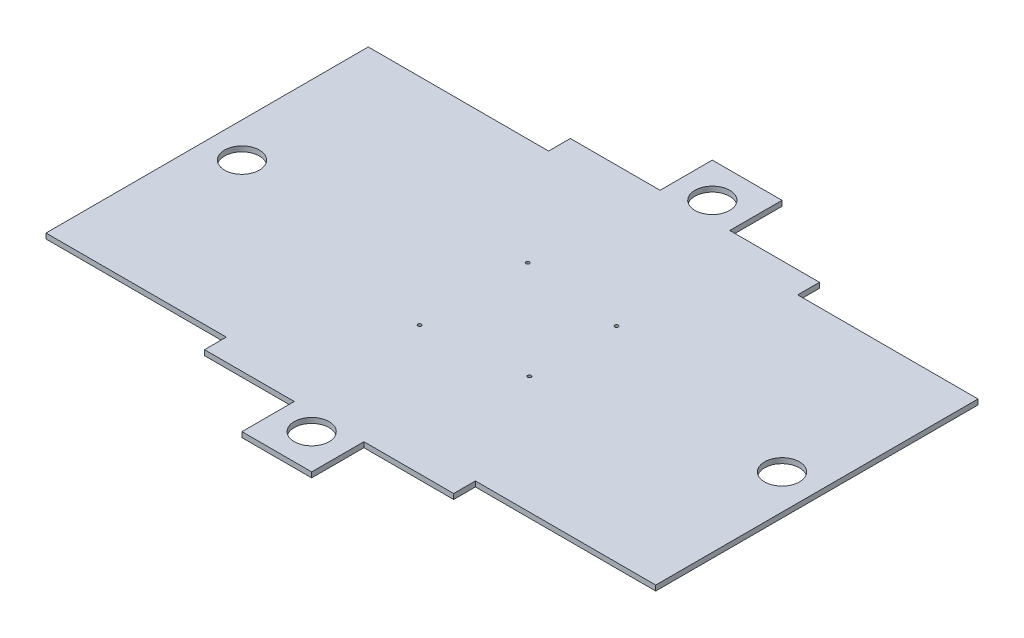
ISO-10303-21;
HEADER;
FILE_DESCRIPTION(('STEP AP214'),'2;1');
FILE_NAME('part.step','',(''),(''),'','','');
FILE_SCHEMA(('AUTOMOTIVE_DESIGN { 1 0 10303 214 1 1 1 1 }'));
ENDSEC;
DATA;
#1=APPLICATION_CONTEXT('core data for automotive mechanical design processes');
#2=APPLICATION_PROTOCOL_DEFINITION('international standard','automotive_design',2000,#1);
#3=PRODUCT_CONTEXT('',#1,'mechanical');
#4=PRODUCT('Part','Part','',(#3));
#5=PRODUCT_RELATED_PRODUCT_CATEGORY('part','',(#4));
#6=PRODUCT_DEFINITION_FORMATION('','',#4);
#7=PRODUCT_DEFINITION_CONTEXT('part definition',#1,'design');
#8=PRODUCT_DEFINITION('design','',#6,#7);
#9=PRODUCT_DEFINITION_SHAPE('','',#8);
#10=(LENGTH_UNIT() NAMED_UNIT(*) SI_UNIT(.MILLI.,.METRE.));
#11=(NAMED_UNIT(*) PLANE_ANGLE_UNIT() SI_UNIT($,.RADIAN.));
#12=(NAMED_UNIT(*) SI_UNIT($,.STERADIAN.) SOLID_ANGLE_UNIT());
#13=UNCERTAINTY_MEASURE_WITH_UNIT(LENGTH_MEASURE(1.E-05),#10,'distance_accuracy_value','');
#14=(GEOMETRIC_REPRESENTATION_CONTEXT(3) GLOBAL_UNCERTAINTY_ASSIGNED_CONTEXT((#13)) GLOBAL_UNIT_ASSIGNED_CONTEXT((#10,
#11,#12)) REPRESENTATION_CONTEXT('',''));
#15=CARTESIAN_POINT('',(0.,0.,0.));
#16=DIRECTION('',(0.,0.,1.));
#17=DIRECTION('',(1.,0.,0.));
#18=AXIS2_PLACEMENT_3D('',#15,#16,#17);
#19=CARTESIAN_POINT('',(0.,3.,-69.7038109466497));
#20=DIRECTION('',(0.,0.,-1.));
#21=DIRECTION('',(-1.,0.,0.));
#22=AXIS2_PLACEMENT_3D('',#19,#20,#21);
#23=PLANE('',#22);
#24=DIRECTION('',(1.,0.,0.));
#25=VECTOR('',#24,1.);
#26=CARTESIAN_POINT('',(0.,0.,-69.7038109466497));
#27=LINE('',#26,#25);
#28=CARTESIAN_POINT('',(-215.290938791968,0.,-69.7038109466496));
#29=VERTEX_POINT('',#28);
#30=CARTESIAN_POINT('',(-111.790938791968,0.,-69.7038109466496));
#31=VERTEX_POINT('',#30);
#32=EDGE_CURVE('E230',#29,#31,#27,.T.);
#33=ORIENTED_EDGE('',*,*,#32,.F.);
#34=DIRECTION('',(0.,-1.,0.));
#35=VECTOR('',#34,1.);
#36=CARTESIAN_POINT('',(-215.290938791968,3.,-69.7038109466496));
#37=LINE('',#36,#35);
#38=CARTESIAN_POINT('',(-215.290938791968,3.,-69.7038109466496));
#39=VERTEX_POINT('',#38);
#40=EDGE_CURVE('E11',#39,#29,#37,.T.);
#41=ORIENTED_EDGE('',*,*,#40,.F.);
#42=DIRECTION('',(1.,0.,0.));
#43=VECTOR('',#42,1.);
#44=CARTESIAN_POINT('',(0.,3.,-69.7038109466497));
#45=LINE('',#44,#43);
#46=CARTESIAN_POINT('',(-111.790938791968,3.,-69.7038109466496));
#47=VERTEX_POINT('',#46);
#48=EDGE_CURVE('E366',#39,#47,#45,.T.);
#49=ORIENTED_EDGE('',*,*,#48,.T.);
#50=DIRECTION('',(0.,-1.,0.));
#51=VECTOR('',#50,1.);
#52=CARTESIAN_POINT('',(-111.790938791968,3.,-69.7038109466496));
#53=LINE('',#52,#51);
#54=EDGE_CURVE('E56',#47,#31,#53,.T.);
#55=ORIENTED_EDGE('',*,*,#54,.T.);
#56=EDGE_LOOP('',(#33,#41,#49,#55));
#57=FACE_BOUND('',#56,.T.);
#58=ADVANCED_FACE('F39',(#57),#23,.T.);
#59=CARTESIAN_POINT('',(-215.290938791968,3.,0.));
#60=DIRECTION('',(-1.,0.,0.));
#61=DIRECTION('',(0.,0.,1.));
#62=AXIS2_PLACEMENT_3D('',#59,#60,#61);
#63=PLANE('',#62);
#64=DIRECTION('',(0.,0.,-1.));
#65=VECTOR('',#64,1.);
#66=CARTESIAN_POINT('',(-215.290938791968,0.,0.));
#67=LINE('',#66,#65);
#68=CARTESIAN_POINT('',(-215.290938791968,0.,115.29618905335));
#69=VERTEX_POINT('',#68);
#70=EDGE_CURVE('E232',#69,#29,#67,.T.);
#71=ORIENTED_EDGE('',*,*,#70,.F.);
#72=DIRECTION('',(0.,-1.,0.));
#73=VECTOR('',#72,1.);
#74=CARTESIAN_POINT('',(-215.290938791968,3.,115.29618905335));
#75=LINE('',#74,#73);
#76=CARTESIAN_POINT('',(-215.290938791968,3.,115.29618905335));
#77=VERTEX_POINT('',#76);
#78=EDGE_CURVE('E48',#77,#69,#75,.T.);
#79=ORIENTED_EDGE('',*,*,#78,.F.);
#80=DIRECTION('',(0.,0.,-1.));
#81=VECTOR('',#80,1.);
#82=CARTESIAN_POINT('',(-215.290938791968,3.,0.));
#83=LINE('',#82,#81);
#84=EDGE_CURVE('E364',#77,#39,#83,.T.);
#85=ORIENTED_EDGE('',*,*,#84,.T.);
#86=ORIENTED_EDGE('',*,*,#40,.T.);
#87=EDGE_LOOP('',(#71,#79,#85,#86));
#88=FACE_BOUND('',#87,.T.);
#89=ADVANCED_FACE('F350',(#88),#63,.T.);
#90=CARTESIAN_POINT('',(0.,3.,115.29618905335));
#91=DIRECTION('',(0.,0.,1.));
#92=DIRECTION('',(1.,0.,0.));
#93=AXIS2_PLACEMENT_3D('',#90,#91,#92);
#94=PLANE('',#93);
#95=DIRECTION('',(-1.,0.,0.));
#96=VECTOR('',#95,1.);
#97=CARTESIAN_POINT('',(0.,0.,115.29618905335));
#98=LINE('',#97,#96);
#99=CARTESIAN_POINT('',(-111.790938791968,0.,115.29618905335));
#100=VERTEX_POINT('',#99);
#101=EDGE_CURVE('E235',#100,#69,#98,.T.);
#102=ORIENTED_EDGE('',*,*,#101,.F.);
#103=DIRECTION('',(0.,-1.,0.));
#104=VECTOR('',#103,1.);
#105=CARTESIAN_POINT('',(-111.790938791968,3.,115.29618905335));
#106=LINE('',#105,#104);
#107=CARTESIAN_POINT('',(-111.790938791968,3.,115.29618905335));
#108=VERTEX_POINT('',#107);
#109=EDGE_CURVE('E339',#108,#100,#106,.T.);
#110=ORIENTED_EDGE('',*,*,#109,.F.);
#111=DIRECTION('',(-1.,0.,0.));
#112=VECTOR('',#111,1.);
#113=CARTESIAN_POINT('',(0.,3.,115.29618905335));
#114=LINE('',#113,#112);
#115=EDGE_CURVE('E346',#108,#77,#114,.T.);
#116=ORIENTED_EDGE('',*,*,#115,.T.);
#117=ORIENTED_EDGE('',*,*,#78,.T.);
#118=EDGE_LOOP('',(#102,#110,#116,#117));
#119=FACE_BOUND('',#118,.T.);
#120=ADVANCED_FACE('F344',(#119),#94,.T.);
#121=CARTESIAN_POINT('',(-111.790938791968,3.,2.48225748382609E-13));
#122=DIRECTION('',(1.,0.,0.));
#123=DIRECTION('',(0.,0.,-1.));
#124=AXIS2_PLACEMENT_3D('',#121,#122,#123);
#125=PLANE('',#124);
#126=DIRECTION('',(0.,0.,1.));
#127=VECTOR('',#126,1.);
#128=CARTESIAN_POINT('',(-111.790938791968,0.,2.48225748382609E-13));
#129=LINE('',#128,#127);
#130=CARTESIAN_POINT('',(-111.790938791968,0.,127.79618905335));
#131=VERTEX_POINT('',#130);
#132=EDGE_CURVE('E238',#100,#131,#129,.T.);
#133=ORIENTED_EDGE('',*,*,#132,.T.);
#134=DIRECTION('',(0.,-1.,0.));
#135=VECTOR('',#134,1.);
#136=CARTESIAN_POINT('',(-111.790938791968,3.,127.79618905335));
#137=LINE('',#136,#135);
#138=CARTESIAN_POINT('',(-111.790938791968,3.,127.79618905335));
#139=VERTEX_POINT('',#138);
#140=EDGE_CURVE('E336',#139,#131,#137,.T.);
#141=ORIENTED_EDGE('',*,*,#140,.F.);
#142=DIRECTION('',(0.,0.,1.));
#143=VECTOR('',#142,1.);
#144=CARTESIAN_POINT('',(-111.790938791968,3.,2.48225748382609E-13));
#145=LINE('',#144,#143);
#146=EDGE_CURVE('E360',#108,#139,#145,.T.);
#147=ORIENTED_EDGE('',*,*,#146,.F.);
#148=ORIENTED_EDGE('',*,*,#109,.T.);
#149=EDGE_LOOP('',(#133,#141,#147,#148));
#150=FACE_BOUND('',#149,.T.);
#151=ADVANCED_FACE('F357',(#150),#125,.F.);
#152=CARTESIAN_POINT('',(-1.37749778200359E-13,3.,127.79618905335));
#153=DIRECTION('',(0.,0.,-1.));
#154=DIRECTION('',(-1.,0.,0.));
#155=AXIS2_PLACEMENT_3D('',#152,#153,#154);
#156=PLANE('',#155);
#157=DIRECTION('',(1.,0.,0.));
#158=VECTOR('',#157,1.);
#159=CARTESIAN_POINT('',(-1.37749778200359E-13,0.,127.79618905335));
#160=LINE('',#159,#158);
#161=CARTESIAN_POINT('',(-60.2909387919644,0.,127.79618905335));
#162=VERTEX_POINT('',#161);
#163=EDGE_CURVE('E241',#131,#162,#160,.T.);
#164=ORIENTED_EDGE('',*,*,#163,.T.);
#165=DIRECTION('',(0.,-1.,0.));
#166=VECTOR('',#165,1.);
#167=CARTESIAN_POINT('',(-60.2909387919644,3.,127.79618905335));
#168=LINE('',#167,#166);
#169=CARTESIAN_POINT('',(-60.2909387919644,3.,127.79618905335));
#170=VERTEX_POINT('',#169);
#171=EDGE_CURVE('E333',#170,#162,#168,.T.);
#172=ORIENTED_EDGE('',*,*,#171,.F.);
#173=DIRECTION('',(1.,0.,0.));
#174=VECTOR('',#173,1.);
#175=CARTESIAN_POINT('',(-1.37749778200359E-13,3.,127.79618905335));
#176=LINE('',#175,#174);
#177=EDGE_CURVE('E362',#139,#170,#176,.T.);
#178=ORIENTED_EDGE('',*,*,#177,.F.);
#179=ORIENTED_EDGE('',*,*,#140,.T.);
#180=EDGE_LOOP('',(#164,#172,#178,#179));
#181=FACE_BOUND('',#180,.T.);
#182=ADVANCED_FACE('F430',(#181),#156,.F.);
#183=CARTESIAN_POINT('',(-60.2909387919644,3.,0.));
#184=DIRECTION('',(1.,0.,0.));
#185=DIRECTION('',(0.,0.,-1.));
#186=AXIS2_PLACEMENT_3D('',#183,#184,#185);
#187=PLANE('',#186);
#188=DIRECTION('',(0.,0.,1.));
#189=VECTOR('',#188,1.);
#190=CARTESIAN_POINT('',(-60.2909387919644,0.,0.));
#191=LINE('',#190,#189);
#192=CARTESIAN_POINT('',(-60.2909387919644,0.,157.79618905335));
#193=VERTEX_POINT('',#192);
#194=EDGE_CURVE('E244',#162,#193,#191,.T.);
#195=ORIENTED_EDGE('',*,*,#194,.T.);
#196=DIRECTION('',(0.,-1.,0.));
#197=VECTOR('',#196,1.);
#198=CARTESIAN_POINT('',(-60.2909387919644,3.,157.79618905335));
#199=LINE('',#198,#197);
#200=CARTESIAN_POINT('',(-60.2909387919644,3.,157.79618905335));
#201=VERTEX_POINT('',#200);
#202=EDGE_CURVE('E330',#201,#193,#199,.T.);
#203=ORIENTED_EDGE('',*,*,#202,.F.);
#204=DIRECTION('',(0.,0.,1.));
#205=VECTOR('',#204,1.);
#206=CARTESIAN_POINT('',(-60.2909387919644,3.,0.));
#207=LINE('',#206,#205);
#208=EDGE_CURVE('E371',#170,#201,#207,.T.);
#209=ORIENTED_EDGE('',*,*,#208,.F.);
#210=ORIENTED_EDGE('',*,*,#171,.T.);
#211=EDGE_LOOP('',(#195,#203,#209,#210));
#212=FACE_BOUND('',#211,.T.);
#213=ADVANCED_FACE('F433',(#212),#187,.F.);
#214=CARTESIAN_POINT('',(0.,3.,157.79618905335));
#215=DIRECTION('',(0.,0.,-1.));
#216=DIRECTION('',(-1.,0.,0.));
#217=AXIS2_PLACEMENT_3D('',#214,#215,#216);
#218=PLANE('',#217);
#219=DIRECTION('',(1.,0.,0.));
#220=VECTOR('',#219,1.);
#221=CARTESIAN_POINT('',(0.,0.,157.79618905335));
#222=LINE('',#221,#220);
#223=CARTESIAN_POINT('',(-20.2909387919713,0.,157.79618905335));
#224=VERTEX_POINT('',#223);
#225=EDGE_CURVE('E247',#193,#224,#222,.T.);
#226=ORIENTED_EDGE('',*,*,#225,.T.);
#227=DIRECTION('',(0.,-1.,0.));
#228=VECTOR('',#227,1.);
#229=CARTESIAN_POINT('',(-20.2909387919713,3.,157.79618905335));
#230=LINE('',#229,#228);
#231=CARTESIAN_POINT('',(-20.2909387919713,3.,157.79618905335));
#232=VERTEX_POINT('',#231);
#233=EDGE_CURVE('E327',#232,#224,#230,.T.);
#234=ORIENTED_EDGE('',*,*,#233,.F.);
#235=DIRECTION('',(1.,0.,0.));
#236=VECTOR('',#235,1.);
#237=CARTESIAN_POINT('',(0.,3.,157.79618905335));
#238=LINE('',#237,#236);
#239=EDGE_CURVE('E374',#201,#232,#238,.T.);
#240=ORIENTED_EDGE('',*,*,#239,.F.);
#241=ORIENTED_EDGE('',*,*,#202,.T.);
#242=EDGE_LOOP('',(#226,#234,#240,#241));
#243=FACE_BOUND('',#242,.T.);
#244=ADVANCED_FACE('F437',(#243),#218,.F.);
#245=CARTESIAN_POINT('',(-20.2909387919713,3.,0.));
#246=DIRECTION('',(-1.,0.,0.));
#247=DIRECTION('',(0.,0.,1.));
#248=AXIS2_PLACEMENT_3D('',#245,#246,#247);
#249=PLANE('',#248);
#250=DIRECTION('',(0.,0.,-1.));
#251=VECTOR('',#250,1.);
#252=CARTESIAN_POINT('',(-20.2909387919713,0.,0.));
#253=LINE('',#252,#251);
#254=CARTESIAN_POINT('',(-20.2909387919713,0.,127.79618905335));
#255=VERTEX_POINT('',#254);
#256=EDGE_CURVE('E250',#224,#255,#253,.T.);
#257=ORIENTED_EDGE('',*,*,#256,.T.);
#258=DIRECTION('',(0.,-1.,0.));
#259=VECTOR('',#258,1.);
#260=CARTESIAN_POINT('',(-20.2909387919713,3.,127.79618905335));
#261=LINE('',#260,#259);
#262=CARTESIAN_POINT('',(-20.2909387919713,3.,127.79618905335));
#263=VERTEX_POINT('',#262);
#264=EDGE_CURVE('E325',#263,#255,#261,.T.);
#265=ORIENTED_EDGE('',*,*,#264,.F.);
#266=DIRECTION('',(0.,0.,-1.));
#267=VECTOR('',#266,1.);
#268=CARTESIAN_POINT('',(-20.2909387919713,3.,0.));
#269=LINE('',#268,#267);
#270=EDGE_CURVE('E377',#232,#263,#269,.T.);
#271=ORIENTED_EDGE('',*,*,#270,.F.);
#272=ORIENTED_EDGE('',*,*,#233,.T.);
#273=EDGE_LOOP('',(#257,#265,#271,#272));
#274=FACE_BOUND('',#273,.T.);
#275=ADVANCED_FACE('F441',(#274),#249,.F.);
#276=CARTESIAN_POINT('',(1.37749778200359E-13,3.,127.79618905335));
#277=DIRECTION('',(0.,0.,1.));
#278=DIRECTION('',(1.,0.,0.));
#279=AXIS2_PLACEMENT_3D('',#276,#277,#278);
#280=PLANE('',#279);
#281=DIRECTION('',(-1.,0.,0.));
#282=VECTOR('',#281,1.);
#283=CARTESIAN_POINT('',(1.37749778200359E-13,0.,127.79618905335));
#284=LINE('',#283,#282);
#285=CARTESIAN_POINT('',(31.209061208032,0.,127.79618905335));
#286=VERTEX_POINT('',#285);
#287=EDGE_CURVE('E253',#286,#255,#284,.T.);
#288=ORIENTED_EDGE('',*,*,#287,.F.);
#289=DIRECTION('',(0.,-1.,0.));
#290=VECTOR('',#289,1.);
#291=CARTESIAN_POINT('',(31.209061208032,3.,127.79618905335));
#292=LINE('',#291,#290);
#293=CARTESIAN_POINT('',(31.209061208032,3.,127.79618905335));
#294=VERTEX_POINT('',#293);
#295=EDGE_CURVE('E323',#294,#286,#292,.T.);
#296=ORIENTED_EDGE('',*,*,#295,.F.);
#297=DIRECTION('',(-1.,0.,0.));
#298=VECTOR('',#297,1.);
#299=CARTESIAN_POINT('',(1.37749778200359E-13,3.,127.79618905335));
#300=LINE('',#299,#298);
#301=EDGE_CURVE('E379',#294,#263,#300,.T.);
#302=ORIENTED_EDGE('',*,*,#301,.T.);
#303=ORIENTED_EDGE('',*,*,#264,.T.);
#304=EDGE_LOOP('',(#288,#296,#302,#303));
#305=FACE_BOUND('',#304,.T.);
#306=ADVANCED_FACE('F445',(#305),#280,.T.);
#307=CARTESIAN_POINT('',(31.2090612080317,3.,0.));
#308=DIRECTION('',(1.,0.,0.));
#309=DIRECTION('',(0.,0.,-1.));
#310=AXIS2_PLACEMENT_3D('',#307,#308,#309);
#311=PLANE('',#310);
#312=DIRECTION('',(0.,0.,1.));
#313=VECTOR('',#312,1.);
#314=CARTESIAN_POINT('',(31.2090612080317,0.,0.));
#315=LINE('',#314,#313);
#316=CARTESIAN_POINT('',(31.209061208032,0.,115.296189053348));
#317=VERTEX_POINT('',#316);
#318=EDGE_CURVE('E256',#317,#286,#315,.T.);
#319=ORIENTED_EDGE('',*,*,#318,.F.);
#320=DIRECTION('',(0.,-1.,0.));
#321=VECTOR('',#320,1.);
#322=CARTESIAN_POINT('',(31.209061208032,3.,115.296189053348));
#323=LINE('',#322,#321);
#324=CARTESIAN_POINT('',(31.209061208032,3.,115.296189053348));
#325=VERTEX_POINT('',#324);
#326=EDGE_CURVE('E321',#325,#317,#323,.T.);
#327=ORIENTED_EDGE('',*,*,#326,.F.);
#328=DIRECTION('',(0.,0.,1.));
#329=VECTOR('',#328,1.);
#330=CARTESIAN_POINT('',(31.2090612080317,3.,0.));
#331=LINE('',#330,#329);
#332=EDGE_CURVE('E382',#325,#294,#331,.T.);
#333=ORIENTED_EDGE('',*,*,#332,.T.);
#334=ORIENTED_EDGE('',*,*,#295,.T.);
#335=EDGE_LOOP('',(#319,#327,#333,#334));
#336=FACE_BOUND('',#335,.T.);
#337=ADVANCED_FACE('F449',(#336),#311,.T.);
#338=CARTESIAN_POINT('',(0.,3.,115.296189053348));
#339=DIRECTION('',(0.,0.,1.));
#340=DIRECTION('',(1.,0.,0.));
#341=AXIS2_PLACEMENT_3D('',#338,#339,#340);
#342=PLANE('',#341);
#343=DIRECTION('',(-1.,0.,0.));
#344=VECTOR('',#343,1.);
#345=CARTESIAN_POINT('',(0.,0.,115.296189053348));
#346=LINE('',#345,#344);
#347=CARTESIAN_POINT('',(134.709061208032,0.,115.296189053348));
#348=VERTEX_POINT('',#347);
#349=EDGE_CURVE('E259',#348,#317,#346,.T.);
#350=ORIENTED_EDGE('',*,*,#349,.F.);
#351=DIRECTION('',(0.,-1.,0.));
#352=VECTOR('',#351,1.);
#353=CARTESIAN_POINT('',(134.709061208032,3.,115.296189053348));
#354=LINE('',#353,#352);
#355=CARTESIAN_POINT('',(134.709061208032,3.,115.296189053348));
#356=VERTEX_POINT('',#355);
#357=EDGE_CURVE('E319',#356,#348,#354,.T.);
#358=ORIENTED_EDGE('',*,*,#357,.F.);
#359=DIRECTION('',(-1.,0.,0.));
#360=VECTOR('',#359,1.);
#361=CARTESIAN_POINT('',(0.,3.,115.296189053348));
#362=LINE('',#361,#360);
#363=EDGE_CURVE('E385',#356,#325,#362,.T.);
#364=ORIENTED_EDGE('',*,*,#363,.T.);
#365=ORIENTED_EDGE('',*,*,#326,.T.);
#366=EDGE_LOOP('',(#350,#358,#364,#365));
#367=FACE_BOUND('',#366,.T.);
#368=ADVANCED_FACE('F453',(#367),#342,.T.);
#369=CARTESIAN_POINT('',(134.709061208032,3.,0.));
#370=DIRECTION('',(1.,0.,0.));
#371=DIRECTION('',(0.,0.,-1.));
#372=AXIS2_PLACEMENT_3D('',#369,#370,#371);
#373=PLANE('',#372);
#374=DIRECTION('',(0.,0.,1.));
#375=VECTOR('',#374,1.);
#376=CARTESIAN_POINT('',(134.709061208032,0.,0.));
#377=LINE('',#376,#375);
#378=CARTESIAN_POINT('',(134.709061208032,0.,-69.7038109466495));
#379=VERTEX_POINT('',#378);
#380=EDGE_CURVE('E262',#379,#348,#377,.T.);
#381=ORIENTED_EDGE('',*,*,#380,.F.);
#382=DIRECTION('',(0.,-1.,0.));
#383=VECTOR('',#382,1.);
#384=CARTESIAN_POINT('',(134.709061208032,3.,-69.7038109466495));
#385=LINE('',#384,#383);
#386=CARTESIAN_POINT('',(134.709061208032,3.,-69.7038109466495));
#387=VERTEX_POINT('',#386);
#388=EDGE_CURVE('E317',#387,#379,#385,.T.);
#389=ORIENTED_EDGE('',*,*,#388,.F.);
#390=DIRECTION('',(0.,0.,1.));
#391=VECTOR('',#390,1.);
#392=CARTESIAN_POINT('',(134.709061208032,3.,0.));
#393=LINE('',#392,#391);
#394=EDGE_CURVE('E388',#387,#356,#393,.T.);
#395=ORIENTED_EDGE('',*,*,#394,.T.);
#396=ORIENTED_EDGE('',*,*,#357,.T.);
#397=EDGE_LOOP('',(#381,#389,#395,#396));
#398=FACE_BOUND('',#397,.T.);
#399=ADVANCED_FACE('F457',(#398),#373,.T.);
#400=CARTESIAN_POINT('',(1.12154747560999E-13,3.,-69.7038109466497));
#401=DIRECTION('',(0.,0.,-1.));
#402=DIRECTION('',(-1.,0.,0.));
#403=AXIS2_PLACEMENT_3D('',#400,#401,#402);
#404=PLANE('',#403);
#405=DIRECTION('',(1.,0.,0.));
#406=VECTOR('',#405,1.);
#407=CARTESIAN_POINT('',(1.12154747560999E-13,0.,-69.7038109466497));
#408=LINE('',#407,#406);
#409=CARTESIAN_POINT('',(31.2090612080319,0.,-69.7038109466496));
#410=VERTEX_POINT('',#409);
#411=EDGE_CURVE('E265',#410,#379,#408,.T.);
#412=ORIENTED_EDGE('',*,*,#411,.F.);
#413=DIRECTION('',(0.,-1.,0.));
#414=VECTOR('',#413,1.);
#415=CARTESIAN_POINT('',(31.2090612080319,3.,-69.7038109466496));
#416=LINE('',#415,#414);
#417=CARTESIAN_POINT('',(31.2090612080319,3.,-69.7038109466496));
#418=VERTEX_POINT('',#417);
#419=EDGE_CURVE('E315',#418,#410,#416,.T.);
#420=ORIENTED_EDGE('',*,*,#419,.F.);
#421=DIRECTION('',(1.,0.,0.));
#422=VECTOR('',#421,1.);
#423=CARTESIAN_POINT('',(1.12154747560999E-13,3.,-69.7038109466497));
#424=LINE('',#423,#422);
#425=EDGE_CURVE('E391',#418,#387,#424,.T.);
#426=ORIENTED_EDGE('',*,*,#425,.T.);
#427=ORIENTED_EDGE('',*,*,#388,.T.);
#428=EDGE_LOOP('',(#412,#420,#426,#427));
#429=FACE_BOUND('',#428,.T.);
#430=ADVANCED_FACE('F461',(#429),#404,.T.);
#431=CARTESIAN_POINT('',(31.2090612080316,3.,1.3859607332037E-13));
#432=DIRECTION('',(-1.,0.,0.));
#433=DIRECTION('',(0.,0.,1.));
#434=AXIS2_PLACEMENT_3D('',#431,#432,#433);
#435=PLANE('',#434);
#436=DIRECTION('',(0.,0.,-1.));
#437=VECTOR('',#436,1.);
#438=CARTESIAN_POINT('',(31.2090612080316,0.,1.3859607332037E-13));
#439=LINE('',#438,#437);
#440=CARTESIAN_POINT('',(31.2090612080319,0.,-82.2038109466496));
#441=VERTEX_POINT('',#440);
#442=EDGE_CURVE('E268',#410,#441,#439,.T.);
#443=ORIENTED_EDGE('',*,*,#442,.T.);
#444=DIRECTION('',(0.,-1.,0.));
#445=VECTOR('',#444,1.);
#446=CARTESIAN_POINT('',(31.2090612080319,3.,-82.2038109466496));
#447=LINE('',#446,#445);
#448=CARTESIAN_POINT('',(31.2090612080319,3.,-82.2038109466496));
#449=VERTEX_POINT('',#448);
#450=EDGE_CURVE('E312',#449,#441,#447,.T.);
#451=ORIENTED_EDGE('',*,*,#450,.F.);
#452=DIRECTION('',(0.,0.,-1.));
#453=VECTOR('',#452,1.);
#454=CARTESIAN_POINT('',(31.2090612080316,3.,1.3859607332037E-13));
#455=LINE('',#454,#453);
#456=EDGE_CURVE('E394',#418,#449,#455,.T.);
#457=ORIENTED_EDGE('',*,*,#456,.F.);
#458=ORIENTED_EDGE('',*,*,#419,.T.);
#459=EDGE_LOOP('',(#443,#451,#457,#458));
#460=FACE_BOUND('',#459,.T.);
#461=ADVANCED_FACE('F465',(#460),#435,.F.);
#462=CARTESIAN_POINT('',(0.,3.,-82.2038109466496));
#463=DIRECTION('',(0.,0.,1.));
#464=DIRECTION('',(1.,0.,0.));
#465=AXIS2_PLACEMENT_3D('',#462,#463,#464);
#466=PLANE('',#465);
#467=DIRECTION('',(-1.,0.,0.));
#468=VECTOR('',#467,1.);
#469=CARTESIAN_POINT('',(0.,0.,-82.2038109466496));
#470=LINE('',#469,#468);
#471=CARTESIAN_POINT('',(-20.2909387919714,0.,-82.2038109466496));
#472=VERTEX_POINT('',#471);
#473=EDGE_CURVE('E271',#441,#472,#470,.T.);
#474=ORIENTED_EDGE('',*,*,#473,.T.);
#475=DIRECTION('',(0.,-1.,0.));
#476=VECTOR('',#475,1.);
#477=CARTESIAN_POINT('',(-20.2909387919714,3.,-82.2038109466496));
#478=LINE('',#477,#476);
#479=CARTESIAN_POINT('',(-20.2909387919714,3.,-82.2038109466496));
#480=VERTEX_POINT('',#479);
#481=EDGE_CURVE('E310',#480,#472,#478,.T.);
#482=ORIENTED_EDGE('',*,*,#481,.F.);
#483=DIRECTION('',(-1.,0.,0.));
#484=VECTOR('',#483,1.);
#485=CARTESIAN_POINT('',(0.,3.,-82.2038109466496));
#486=LINE('',#485,#484);
#487=EDGE_CURVE('E397',#449,#480,#486,.T.);
#488=ORIENTED_EDGE('',*,*,#487,.F.);
#489=ORIENTED_EDGE('',*,*,#450,.T.);
#490=EDGE_LOOP('',(#474,#482,#488,#489));
#491=FACE_BOUND('',#490,.T.);
#492=ADVANCED_FACE('F469',(#491),#466,.F.);
#493=CARTESIAN_POINT('',(-20.2909387919714,3.,0.));
#494=DIRECTION('',(1.,0.,0.));
#495=DIRECTION('',(0.,0.,-1.));
#496=AXIS2_PLACEMENT_3D('',#493,#494,#495);
#497=PLANE('',#496);
#498=DIRECTION('',(0.,0.,1.));
#499=VECTOR('',#498,1.);
#500=CARTESIAN_POINT('',(-20.2909387919714,0.,0.));
#501=LINE('',#500,#499);
#502=CARTESIAN_POINT('',(-20.2909387919714,0.,-112.203810946649));
#503=VERTEX_POINT('',#502);
#504=EDGE_CURVE('E274',#503,#472,#501,.T.);
#505=ORIENTED_EDGE('',*,*,#504,.F.);
#506=DIRECTION('',(0.,-1.,0.));
#507=VECTOR('',#506,1.);
#508=CARTESIAN_POINT('',(-20.2909387919714,3.,-112.203810946649));
#509=LINE('',#508,#507);
#510=CARTESIAN_POINT('',(-20.2909387919714,3.,-112.203810946649));
#511=VERTEX_POINT('',#510);
#512=EDGE_CURVE('E308',#511,#503,#509,.T.);
#513=ORIENTED_EDGE('',*,*,#512,.F.);
#514=DIRECTION('',(0.,0.,1.));
#515=VECTOR('',#514,1.);
#516=CARTESIAN_POINT('',(-20.2909387919714,3.,0.));
#517=LINE('',#516,#515);
#518=EDGE_CURVE('E399',#511,#480,#517,.T.);
#519=ORIENTED_EDGE('',*,*,#518,.T.);
#520=ORIENTED_EDGE('',*,*,#481,.T.);
#521=EDGE_LOOP('',(#505,#513,#519,#520));
#522=FACE_BOUND('',#521,.T.);
#523=ADVANCED_FACE('F473',(#522),#497,.T.);
#524=CARTESIAN_POINT('',(-5.83927754829751E-13,3.,-112.203810946649));
#525=DIRECTION('',(0.,0.,-1.));
#526=DIRECTION('',(-1.,0.,0.));
#527=AXIS2_PLACEMENT_3D('',#524,#525,#526);
#528=PLANE('',#527);
#529=DIRECTION('',(1.,0.,0.));
#530=VECTOR('',#529,1.);
#531=CARTESIAN_POINT('',(-5.83927754829751E-13,0.,-112.203810946649));
#532=LINE('',#531,#530);
#533=CARTESIAN_POINT('',(-60.2909387919644,0.,-112.203810946649));
#534=VERTEX_POINT('',#533);
#535=EDGE_CURVE('E277',#534,#503,#532,.T.);
#536=ORIENTED_EDGE('',*,*,#535,.F.);
#537=DIRECTION('',(0.,-1.,0.));
#538=VECTOR('',#537,1.);
#539=CARTESIAN_POINT('',(-60.2909387919644,3.,-112.203810946649));
#540=LINE('',#539,#538);
#541=CARTESIAN_POINT('',(-60.2909387919644,3.,-112.203810946649));
#542=VERTEX_POINT('',#541);
#543=EDGE_CURVE('E187',#542,#534,#540,.T.);
#544=ORIENTED_EDGE('',*,*,#543,.F.);
#545=DIRECTION('',(1.,0.,0.));
#546=VECTOR('',#545,1.);
#547=CARTESIAN_POINT('',(-5.83927754829751E-13,3.,-112.203810946649));
#548=LINE('',#547,#546);
#549=EDGE_CURVE('E198',#542,#511,#548,.T.);
#550=ORIENTED_EDGE('',*,*,#549,.T.);
#551=ORIENTED_EDGE('',*,*,#512,.T.);
#552=EDGE_LOOP('',(#536,#544,#550,#551));
#553=FACE_BOUND('',#552,.T.);
#554=ADVANCED_FACE('F403',(#553),#528,.T.);
#555=CARTESIAN_POINT('',(-60.2909387919644,3.,0.));
#556=DIRECTION('',(-1.,0.,0.));
#557=DIRECTION('',(0.,0.,1.));
#558=AXIS2_PLACEMENT_3D('',#555,#556,#557);
#559=PLANE('',#558);
#560=DIRECTION('',(0.,0.,-1.));
#561=VECTOR('',#560,1.);
#562=CARTESIAN_POINT('',(-60.2909387919644,0.,0.));
#563=LINE('',#562,#561);
#564=CARTESIAN_POINT('',(-60.2909387919644,0.,-82.2038109466495));
#565=VERTEX_POINT('',#564);
#566=EDGE_CURVE('E183',#565,#534,#563,.T.);
#567=ORIENTED_EDGE('',*,*,#566,.F.);
#568=DIRECTION('',(0.,-1.,0.));
#569=VECTOR('',#568,1.);
#570=CARTESIAN_POINT('',(-60.2909387919644,3.,-82.2038109466495));
#571=LINE('',#570,#569);
#572=CARTESIAN_POINT('',(-60.2909387919644,3.,-82.2038109466495));
#573=VERTEX_POINT('',#572);
#574=EDGE_CURVE('E178',#573,#565,#571,.T.);
#575=ORIENTED_EDGE('',*,*,#574,.F.);
#576=DIRECTION('',(0.,0.,-1.));
#577=VECTOR('',#576,1.);
#578=CARTESIAN_POINT('',(-60.2909387919644,3.,0.));
#579=LINE('',#578,#577);
#580=EDGE_CURVE('E181',#573,#542,#579,.T.);
#581=ORIENTED_EDGE('',*,*,#580,.T.);
#582=ORIENTED_EDGE('',*,*,#543,.T.);
#583=EDGE_LOOP('',(#567,#575,#581,#582));
#584=FACE_BOUND('',#583,.T.);
#585=ADVANCED_FACE('F180',(#584),#559,.T.);
#586=CARTESIAN_POINT('',(2.65819117354068E-13,3.,-82.2038109466493));
#587=DIRECTION('',(0.,0.,-1.));
#588=DIRECTION('',(-1.,0.,0.));
#589=AXIS2_PLACEMENT_3D('',#586,#587,#588);
#590=PLANE('',#589);
#591=DIRECTION('',(1.,0.,0.));
#592=VECTOR('',#591,1.);
#593=CARTESIAN_POINT('',(2.65819117354068E-13,0.,-82.2038109466493));
#594=LINE('',#593,#592);
#595=CARTESIAN_POINT('',(-111.790938791968,0.,-82.2038109466496));
#596=VERTEX_POINT('',#595);
#597=EDGE_CURVE('E281',#596,#565,#594,.T.);
#598=ORIENTED_EDGE('',*,*,#597,.F.);
#599=DIRECTION('',(0.,-1.,0.));
#600=VECTOR('',#599,1.);
#601=CARTESIAN_POINT('',(-111.790938791968,3.,-82.2038109466496));
#602=LINE('',#601,#600);
#603=CARTESIAN_POINT('',(-111.790938791968,3.,-82.2038109466496));
#604=VERTEX_POINT('',#603);
#605=EDGE_CURVE('E117',#604,#596,#602,.T.);
#606=ORIENTED_EDGE('',*,*,#605,.F.);
#607=DIRECTION('',(1.,0.,0.));
#608=VECTOR('',#607,1.);
#609=CARTESIAN_POINT('',(2.65819117354068E-13,3.,-82.2038109466493));
#610=LINE('',#609,#608);
#611=EDGE_CURVE('E195',#604,#573,#610,.T.);
#612=ORIENTED_EDGE('',*,*,#611,.T.);
#613=ORIENTED_EDGE('',*,*,#574,.T.);
#614=EDGE_LOOP('',(#598,#606,#612,#613));
#615=FACE_BOUND('',#614,.T.);
#616=ADVANCED_FACE('F200',(#615),#590,.T.);
#617=CARTESIAN_POINT('',(-5.29093879215605,3.,-2.20381094715202));
#618=DIRECTION('',(0.,-1.,0.));
#619=DIRECTION('',(0.,0.,-1.));
#620=AXIS2_PLACEMENT_3D('',#617,#618,#619);
#621=CYLINDRICAL_SURFACE('',#620,1.);
#622=CARTESIAN_POINT('',(-5.29093879215605,3.,-2.20381094715202));
#623=DIRECTION('',(0.,1.,0.));
#624=DIRECTION('',(0.,0.,1.));
#625=AXIS2_PLACEMENT_3D('',#622,#623,#624);
#626=CIRCLE('',#625,1.);
#627=CARTESIAN_POINT('',(-5.29093879215605,3.,-1.20381094715202));
#628=VERTEX_POINT('',#627);
#629=EDGE_CURVE('E218',#628,#628,#626,.T.);
#630=ORIENTED_EDGE('',*,*,#629,.T.);
#631=EDGE_LOOP('',(#630));
#632=FACE_BOUND('',#631,.T.);
#633=CARTESIAN_POINT('',(-5.29093879215605,0.,-2.20381094715202));
#634=DIRECTION('',(0.,1.,0.));
#635=DIRECTION('',(0.,0.,1.));
#636=AXIS2_PLACEMENT_3D('',#633,#634,#635);
#637=CIRCLE('',#636,1.);
#638=CARTESIAN_POINT('',(-5.29093879215605,0.,-1.20381094715202));
#639=VERTEX_POINT('',#638);
#640=EDGE_CURVE('E298',#639,#639,#637,.T.);
#641=ORIENTED_EDGE('',*,*,#640,.F.);
#642=EDGE_LOOP('',(#641));
#643=FACE_BOUND('',#642,.T.);
#644=ADVANCED_FACE('F482',(#632,#643),#621,.F.);
#645=CARTESIAN_POINT('',(-5.29093879215606,3.,47.796189052848));
#646=DIRECTION('',(0.,-1.,0.));
#647=DIRECTION('',(0.,0.,-1.));
#648=AXIS2_PLACEMENT_3D('',#645,#646,#647);
#649=CYLINDRICAL_SURFACE('',#648,1.);
#650=CARTESIAN_POINT('',(-5.29093879215606,3.,47.796189052848));
#651=DIRECTION('',(0.,1.,0.));
#652=DIRECTION('',(0.,0.,1.));
#653=AXIS2_PLACEMENT_3D('',#650,#651,#652);
#654=CIRCLE('',#653,1.);
#655=CARTESIAN_POINT('',(-5.29093879215606,3.,48.796189052848));
#656=VERTEX_POINT('',#655);
#657=EDGE_CURVE('E215',#656,#656,#654,.T.);
#658=ORIENTED_EDGE('',*,*,#657,.T.);
#659=EDGE_LOOP('',(#658));
#660=FACE_BOUND('',#659,.T.);
#661=CARTESIAN_POINT('',(-5.29093879215606,0.,47.796189052848));
#662=DIRECTION('',(0.,1.,0.));
#663=DIRECTION('',(0.,0.,1.));
#664=AXIS2_PLACEMENT_3D('',#661,#662,#663);
#665=CIRCLE('',#664,1.);
#666=CARTESIAN_POINT('',(-5.29093879215606,0.,48.796189052848));
#667=VERTEX_POINT('',#666);
#668=EDGE_CURVE('E295',#667,#667,#665,.T.);
#669=ORIENTED_EDGE('',*,*,#668,.F.);
#670=EDGE_LOOP('',(#669));
#671=FACE_BOUND('',#670,.T.);
#672=ADVANCED_FACE('F486',(#660,#671),#649,.F.);
#673=CARTESIAN_POINT('',(-62.2909387921561,3.,53.796189052848));
#674=DIRECTION('',(0.,-1.,0.));
#675=DIRECTION('',(0.,0.,-1.));
#676=AXIS2_PLACEMENT_3D('',#673,#674,#675);
#677=CYLINDRICAL_SURFACE('',#676,0.999999999999998);
#678=CARTESIAN_POINT('',(-62.2909387921561,3.,53.796189052848));
#679=DIRECTION('',(0.,1.,0.));
#680=DIRECTION('',(0.,0.,1.));
#681=AXIS2_PLACEMENT_3D('',#678,#679,#680);
#682=CIRCLE('',#681,0.999999999999998);
#683=CARTESIAN_POINT('',(-62.2909387921561,3.,54.796189052848));
#684=VERTEX_POINT('',#683);
#685=EDGE_CURVE('E212',#684,#684,#682,.T.);
#686=ORIENTED_EDGE('',*,*,#685,.T.);
#687=EDGE_LOOP('',(#686));
#688=FACE_BOUND('',#687,.T.);
#689=CARTESIAN_POINT('',(-62.2909387921561,0.,53.796189052848));
#690=DIRECTION('',(0.,1.,0.));
#691=DIRECTION('',(0.,0.,1.));
#692=AXIS2_PLACEMENT_3D('',#689,#690,#691);
#693=CIRCLE('',#692,0.999999999999998);
#694=CARTESIAN_POINT('',(-62.2909387921561,0.,54.796189052848));
#695=VERTEX_POINT('',#694);
#696=EDGE_CURVE('E292',#695,#695,#693,.T.);
#697=ORIENTED_EDGE('',*,*,#696,.F.);
#698=EDGE_LOOP('',(#697));
#699=FACE_BOUND('',#698,.T.);
#700=ADVANCED_FACE('F492',(#688,#699),#677,.F.);
#701=CARTESIAN_POINT('',(-195.290938791966,3.,22.7961890533391));
#702=DIRECTION('',(0.,-1.,0.));
#703=DIRECTION('',(0.,0.,-1.));
#704=AXIS2_PLACEMENT_3D('',#701,#702,#703);
#705=CYLINDRICAL_SURFACE('',#704,9.99999999999994);
#706=CARTESIAN_POINT('',(-195.290938791966,3.,22.7961890533391));
#707=DIRECTION('',(0.,1.,0.));
#708=DIRECTION('',(0.,0.,1.));
#709=AXIS2_PLACEMENT_3D('',#706,#707,#708);
#710=CIRCLE('',#709,9.99999999999994);
#711=CARTESIAN_POINT('',(-195.290938791966,3.,32.796189053339));
#712=VERTEX_POINT('',#711);
#713=EDGE_CURVE('E209',#712,#712,#710,.F.);
#714=ORIENTED_EDGE('',*,*,#713,.F.);
#715=EDGE_LOOP('',(#714));
#716=FACE_BOUND('',#715,.T.);
#717=CARTESIAN_POINT('',(-195.290938791966,0.,22.7961890533391));
#718=DIRECTION('',(0.,1.,0.));
#719=DIRECTION('',(0.,0.,1.));
#720=AXIS2_PLACEMENT_3D('',#717,#718,#719);
#721=CIRCLE('',#720,9.99999999999994);
#722=CARTESIAN_POINT('',(-195.290938791966,0.,32.796189053339));
#723=VERTEX_POINT('',#722);
#724=EDGE_CURVE('E289',#723,#723,#721,.F.);
#725=ORIENTED_EDGE('',*,*,#724,.T.);
#726=EDGE_LOOP('',(#725));
#727=FACE_BOUND('',#726,.T.);
#728=ADVANCED_FACE('F415',(#716,#727),#705,.F.);
#729=CARTESIAN_POINT('',(114.709061208037,3.,22.7961890533391));
#730=DIRECTION('',(0.,-1.,0.));
#731=DIRECTION('',(0.,0.,-1.));
#732=AXIS2_PLACEMENT_3D('',#729,#730,#731);
#733=CYLINDRICAL_SURFACE('',#732,9.99999999999183);
#734=CARTESIAN_POINT('',(114.709061208037,3.,22.7961890533391));
#735=DIRECTION('',(0.,1.,0.));
#736=DIRECTION('',(0.,0.,1.));
#737=AXIS2_PLACEMENT_3D('',#734,#735,#736);
#738=CIRCLE('',#737,9.99999999999183);
#739=CARTESIAN_POINT('',(114.709061208037,3.,32.7961890533309));
#740=VERTEX_POINT('',#739);
#741=EDGE_CURVE('E203',#740,#740,#738,.T.);
#742=ORIENTED_EDGE('',*,*,#741,.T.);
#743=EDGE_LOOP('',(#742));
#744=FACE_BOUND('',#743,.T.);
#745=CARTESIAN_POINT('',(114.709061208037,0.,22.7961890533391));
#746=DIRECTION('',(0.,1.,0.));
#747=DIRECTION('',(0.,0.,1.));
#748=AXIS2_PLACEMENT_3D('',#745,#746,#747);
#749=CIRCLE('',#748,9.99999999999183);
#750=CARTESIAN_POINT('',(114.709061208037,0.,32.7961890533309));
#751=VERTEX_POINT('',#750);
#752=EDGE_CURVE('E286',#751,#751,#749,.T.);
#753=ORIENTED_EDGE('',*,*,#752,.F.);
#754=EDGE_LOOP('',(#753));
#755=FACE_BOUND('',#754,.T.);
#756=ADVANCED_FACE('F408',(#744,#755),#733,.F.);
#757=CARTESIAN_POINT('',(-111.790938791968,3.,4.96451496765218E-13));
#758=DIRECTION('',(-1.,0.,0.));
#759=DIRECTION('',(0.,0.,1.));
#760=AXIS2_PLACEMENT_3D('',#757,#758,#759);
#761=PLANE('',#760);
#762=DIRECTION('',(0.,0.,-1.));
#763=VECTOR('',#762,1.);
#764=CARTESIAN_POINT('',(-111.790938791968,0.,4.96451496765218E-13));
#765=LINE('',#764,#763);
#766=EDGE_CURVE('E283',#31,#596,#765,.T.);
#767=ORIENTED_EDGE('',*,*,#766,.F.);
#768=ORIENTED_EDGE('',*,*,#54,.F.);
#769=DIRECTION('',(0.,0.,-1.));
#770=VECTOR('',#769,1.);
#771=CARTESIAN_POINT('',(-111.790938791968,3.,4.96451496765218E-13));
#772=LINE('',#771,#770);
#773=EDGE_CURVE('E201',#47,#604,#772,.T.);
#774=ORIENTED_EDGE('',*,*,#773,.T.);
#775=ORIENTED_EDGE('',*,*,#605,.T.);
#776=EDGE_LOOP('',(#767,#768,#774,#775));
#777=FACE_BOUND('',#776,.T.);
#778=ADVANCED_FACE('F405',(#777),#761,.T.);
#779=CARTESIAN_POINT('',(-40.2909387919671,3.,-92.203810946646));
#780=DIRECTION('',(0.,-1.,0.));
#781=DIRECTION('',(0.,0.,-1.));
#782=AXIS2_PLACEMENT_3D('',#779,#780,#781);
#783=CYLINDRICAL_SURFACE('',#782,10.0000000000001);
#784=CARTESIAN_POINT('',(-40.2909387919671,3.,-92.203810946646));
#785=DIRECTION('',(0.,1.,0.));
#786=DIRECTION('',(0.,0.,1.));
#787=AXIS2_PLACEMENT_3D('',#784,#785,#786);
#788=CIRCLE('',#787,10.0000000000001);
#789=CARTESIAN_POINT('',(-40.2909387919671,3.,-82.203810946646));
#790=VERTEX_POINT('',#789);
#791=EDGE_CURVE('E542',#790,#790,#788,.T.);
#792=ORIENTED_EDGE('',*,*,#791,.T.);
#793=EDGE_LOOP('',(#792));
#794=FACE_BOUND('',#793,.T.);
#795=CARTESIAN_POINT('',(-40.2909387919671,0.,-92.203810946646));
#796=DIRECTION('',(0.,1.,0.));
#797=DIRECTION('',(0.,0.,1.));
#798=AXIS2_PLACEMENT_3D('',#795,#796,#797);
#799=CIRCLE('',#798,10.0000000000001);
#800=CARTESIAN_POINT('',(-40.2909387919671,0.,-82.203810946646));
#801=VERTEX_POINT('',#800);
#802=EDGE_CURVE('E227',#801,#801,#799,.T.);
#803=ORIENTED_EDGE('',*,*,#802,.F.);
#804=EDGE_LOOP('',(#803));
#805=FACE_BOUND('',#804,.T.);
#806=ADVANCED_FACE('F407',(#794,#805),#783,.F.);
#807=CARTESIAN_POINT('',(-40.2909387919671,3.,137.796189053349));
#808=DIRECTION('',(0.,-1.,0.));
#809=DIRECTION('',(0.,0.,-1.));
#810=AXIS2_PLACEMENT_3D('',#807,#808,#809);
#811=CYLINDRICAL_SURFACE('',#810,9.99999999999997);
#812=CARTESIAN_POINT('',(-40.2909387919671,3.,137.796189053349));
#813=DIRECTION('',(0.,1.,0.));
#814=DIRECTION('',(0.,0.,1.));
#815=AXIS2_PLACEMENT_3D('',#812,#813,#814);
#816=CIRCLE('',#815,9.99999999999997);
#817=CARTESIAN_POINT('',(-40.2909387919671,3.,147.796189053349));
#818=VERTEX_POINT('',#817);
#819=EDGE_CURVE('E304',#818,#818,#816,.F.);
#820=ORIENTED_EDGE('',*,*,#819,.F.);
#821=EDGE_LOOP('',(#820));
#822=FACE_BOUND('',#821,.T.);
#823=CARTESIAN_POINT('',(-40.2909387919671,0.,137.796189053349));
#824=DIRECTION('',(0.,1.,0.));
#825=DIRECTION('',(0.,0.,1.));
#826=AXIS2_PLACEMENT_3D('',#823,#824,#825);
#827=CIRCLE('',#826,9.99999999999997);
#828=CARTESIAN_POINT('',(-40.2909387919671,0.,147.796189053349));
#829=VERTEX_POINT('',#828);
#830=EDGE_CURVE('E224',#829,#829,#827,.F.);
#831=ORIENTED_EDGE('',*,*,#830,.T.);
#832=EDGE_LOOP('',(#831));
#833=FACE_BOUND('',#832,.T.);
#834=ADVANCED_FACE('F41',(#822,#833),#811,.F.);
#835=CARTESIAN_POINT('',(-62.290938792156,3.,-8.20381094715209));
#836=DIRECTION('',(0.,-1.,0.));
#837=DIRECTION('',(0.,0.,-1.));
#838=AXIS2_PLACEMENT_3D('',#835,#836,#837);
#839=CYLINDRICAL_SURFACE('',#838,0.999999999999998);
#840=CARTESIAN_POINT('',(-62.290938792156,3.,-8.20381094715209));
#841=DIRECTION('',(0.,1.,0.));
#842=DIRECTION('',(0.,0.,1.));
#843=AXIS2_PLACEMENT_3D('',#840,#841,#842);
#844=CIRCLE('',#843,0.999999999999998);
#845=CARTESIAN_POINT('',(-62.290938792156,3.,-7.2038109471521));
#846=VERTEX_POINT('',#845);
#847=EDGE_CURVE('E221',#846,#846,#844,.T.);
#848=ORIENTED_EDGE('',*,*,#847,.T.);
#849=EDGE_LOOP('',(#848));
#850=FACE_BOUND('',#849,.T.);
#851=CARTESIAN_POINT('',(-62.290938792156,0.,-8.20381094715209));
#852=DIRECTION('',(0.,1.,0.));
#853=DIRECTION('',(0.,0.,1.));
#854=AXIS2_PLACEMENT_3D('',#851,#852,#853);
#855=CIRCLE('',#854,0.999999999999998);
#856=CARTESIAN_POINT('',(-62.290938792156,0.,-7.2038109471521));
#857=VERTEX_POINT('',#856);
#858=EDGE_CURVE('E301',#857,#857,#855,.T.);
#859=ORIENTED_EDGE('',*,*,#858,.F.);
#860=EDGE_LOOP('',(#859));
#861=FACE_BOUND('',#860,.T.);
#862=ADVANCED_FACE('F497',(#850,#861),#839,.F.);
#863=CARTESIAN_POINT('',(0.,3.,0.));
#864=DIRECTION('',(0.,1.,0.));
#865=DIRECTION('',(0.,0.,1.));
#866=AXIS2_PLACEMENT_3D('',#863,#864,#865);
#867=PLANE('',#866);
#868=ORIENTED_EDGE('',*,*,#819,.T.);
#869=EDGE_LOOP('',(#868));
#870=FACE_BOUND('',#869,.T.);
#871=ORIENTED_EDGE('',*,*,#791,.F.);
#872=EDGE_LOOP('',(#871));
#873=FACE_BOUND('',#872,.T.);
#874=ORIENTED_EDGE('',*,*,#48,.F.);
#875=ORIENTED_EDGE('',*,*,#84,.F.);
#876=ORIENTED_EDGE('',*,*,#115,.F.);
#877=ORIENTED_EDGE('',*,*,#146,.T.);
#878=ORIENTED_EDGE('',*,*,#177,.T.);
#879=ORIENTED_EDGE('',*,*,#208,.T.);
#880=ORIENTED_EDGE('',*,*,#239,.T.);
#881=ORIENTED_EDGE('',*,*,#270,.T.);
#882=ORIENTED_EDGE('',*,*,#301,.F.);
#883=ORIENTED_EDGE('',*,*,#332,.F.);
#884=ORIENTED_EDGE('',*,*,#363,.F.);
#885=ORIENTED_EDGE('',*,*,#394,.F.);
#886=ORIENTED_EDGE('',*,*,#425,.F.);
#887=ORIENTED_EDGE('',*,*,#456,.T.);
#888=ORIENTED_EDGE('',*,*,#487,.T.);
#889=ORIENTED_EDGE('',*,*,#518,.F.);
#890=ORIENTED_EDGE('',*,*,#549,.F.);
#891=ORIENTED_EDGE('',*,*,#580,.F.);
#892=ORIENTED_EDGE('',*,*,#611,.F.);
#893=ORIENTED_EDGE('',*,*,#773,.F.);
#894=EDGE_LOOP('',(#874,#875,#876,#877,#878,#879,#880,#881,#882,#883,#884,#885,#886,#887,#888,
#889,#890,#891,#892,#893));
#895=FACE_BOUND('',#894,.T.);
#896=ORIENTED_EDGE('',*,*,#741,.F.);
#897=EDGE_LOOP('',(#896));
#898=FACE_BOUND('',#897,.T.);
#899=ORIENTED_EDGE('',*,*,#713,.T.);
#900=EDGE_LOOP('',(#899));
#901=FACE_BOUND('',#900,.T.);
#902=ORIENTED_EDGE('',*,*,#685,.F.);
#903=EDGE_LOOP('',(#902));
#904=FACE_BOUND('',#903,.T.);
#905=ORIENTED_EDGE('',*,*,#657,.F.);
#906=EDGE_LOOP('',(#905));
#907=FACE_BOUND('',#906,.T.);
#908=ORIENTED_EDGE('',*,*,#629,.F.);
#909=EDGE_LOOP('',(#908));
#910=FACE_BOUND('',#909,.T.);
#911=ORIENTED_EDGE('',*,*,#847,.F.);
#912=EDGE_LOOP('',(#911));
#913=FACE_BOUND('',#912,.T.);
#914=ADVANCED_FACE('F192',(#870,#873,#895,#898,#901,#904,#907,#910,#913),#867,.T.);
#915=CARTESIAN_POINT('',(0.,0.,0.));
#916=DIRECTION('',(0.,1.,0.));
#917=DIRECTION('',(0.,0.,1.));
#918=AXIS2_PLACEMENT_3D('',#915,#916,#917);
#919=PLANE('',#918);
#920=ORIENTED_EDGE('',*,*,#830,.F.);
#921=EDGE_LOOP('',(#920));
#922=FACE_BOUND('',#921,.T.);
#923=ORIENTED_EDGE('',*,*,#802,.T.);
#924=EDGE_LOOP('',(#923));
#925=FACE_BOUND('',#924,.T.);
#926=ORIENTED_EDGE('',*,*,#32,.T.);
#927=ORIENTED_EDGE('',*,*,#766,.T.);
#928=ORIENTED_EDGE('',*,*,#597,.T.);
#929=ORIENTED_EDGE('',*,*,#566,.T.);
#930=ORIENTED_EDGE('',*,*,#535,.T.);
#931=ORIENTED_EDGE('',*,*,#504,.T.);
#932=ORIENTED_EDGE('',*,*,#473,.F.);
#933=ORIENTED_EDGE('',*,*,#442,.F.);
#934=ORIENTED_EDGE('',*,*,#411,.T.);
#935=ORIENTED_EDGE('',*,*,#380,.T.);
#936=ORIENTED_EDGE('',*,*,#349,.T.);
#937=ORIENTED_EDGE('',*,*,#318,.T.);
#938=ORIENTED_EDGE('',*,*,#287,.T.);
#939=ORIENTED_EDGE('',*,*,#256,.F.);
#940=ORIENTED_EDGE('',*,*,#225,.F.);
#941=ORIENTED_EDGE('',*,*,#194,.F.);
#942=ORIENTED_EDGE('',*,*,#163,.F.);
#943=ORIENTED_EDGE('',*,*,#132,.F.);
#944=ORIENTED_EDGE('',*,*,#101,.T.);
#945=ORIENTED_EDGE('',*,*,#70,.T.);
#946=EDGE_LOOP('',(#926,#927,#928,#929,#930,#931,#932,#933,#934,#935,#936,#937,#938,#939,#940,
#941,#942,#943,#944,#945));
#947=FACE_BOUND('',#946,.T.);
#948=ORIENTED_EDGE('',*,*,#752,.T.);
#949=EDGE_LOOP('',(#948));
#950=FACE_BOUND('',#949,.T.);
#951=ORIENTED_EDGE('',*,*,#724,.F.);
#952=EDGE_LOOP('',(#951));
#953=FACE_BOUND('',#952,.T.);
#954=ORIENTED_EDGE('',*,*,#696,.T.);
#955=EDGE_LOOP('',(#954));
#956=FACE_BOUND('',#955,.T.);
#957=ORIENTED_EDGE('',*,*,#668,.T.);
#958=EDGE_LOOP('',(#957));
#959=FACE_BOUND('',#958,.T.);
#960=ORIENTED_EDGE('',*,*,#640,.T.);
#961=EDGE_LOOP('',(#960));
#962=FACE_BOUND('',#961,.T.);
#963=ORIENTED_EDGE('',*,*,#858,.T.);
#964=EDGE_LOOP('',(#963));
#965=FACE_BOUND('',#964,.T.);
#966=ADVANCED_FACE('F353',(#922,#925,#947,#950,#953,#956,#959,#962,#965),#919,.F.);
#967=CLOSED_SHELL('',(#58,#89,#120,#151,#182,#213,#244,#275,#306,#337,#368,#399,#430,#461,#492,
#523,#554,#585,#616,#644,#672,#700,#728,#756,#778,#806,#834,#862,#914,#966));
#968=MANIFOLD_SOLID_BREP('B2',#967);
#969=ADVANCED_BREP_SHAPE_REPRESENTATION('',(#18,#968),#14);
#970=SHAPE_DEFINITION_REPRESENTATION(#9,#969);
ENDSEC;
END-ISO-10303-21;
